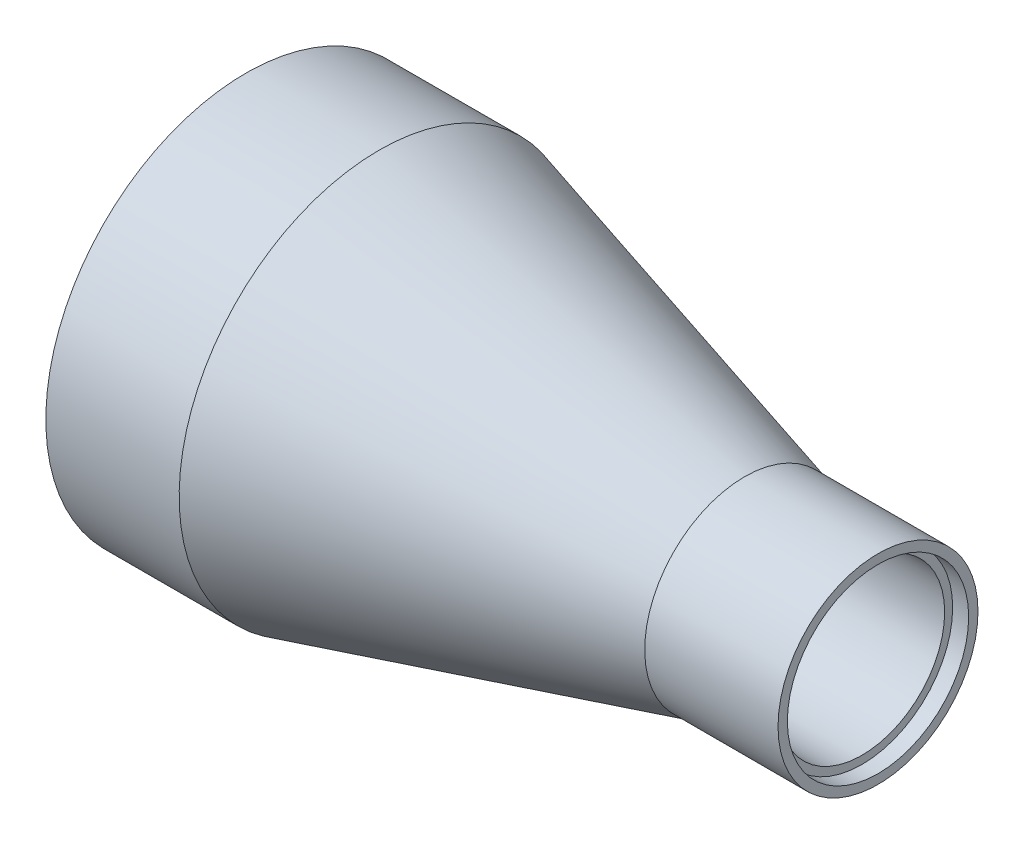
ISO-10303-21;
HEADER;
FILE_DESCRIPTION(('STEP AP214'),'2;1');
FILE_NAME('part.step','',(''),(''),'','','');
FILE_SCHEMA(('AUTOMOTIVE_DESIGN { 1 0 10303 214 1 1 1 1 }'));
ENDSEC;
DATA;
#1=APPLICATION_CONTEXT('core data for automotive mechanical design processes');
#2=APPLICATION_PROTOCOL_DEFINITION('international standard','automotive_design',2000,#1);
#3=PRODUCT_CONTEXT('',#1,'mechanical');
#4=PRODUCT('Part','Part','',(#3));
#5=PRODUCT_RELATED_PRODUCT_CATEGORY('part','',(#4));
#6=PRODUCT_DEFINITION_FORMATION('','',#4);
#7=PRODUCT_DEFINITION_CONTEXT('part definition',#1,'design');
#8=PRODUCT_DEFINITION('design','',#6,#7);
#9=PRODUCT_DEFINITION_SHAPE('','',#8);
#10=(LENGTH_UNIT() NAMED_UNIT(*) SI_UNIT(.MILLI.,.METRE.));
#11=(NAMED_UNIT(*) PLANE_ANGLE_UNIT() SI_UNIT($,.RADIAN.));
#12=(NAMED_UNIT(*) SI_UNIT($,.STERADIAN.) SOLID_ANGLE_UNIT());
#13=UNCERTAINTY_MEASURE_WITH_UNIT(LENGTH_MEASURE(1.E-05),#10,'distance_accuracy_value','');
#14=(GEOMETRIC_REPRESENTATION_CONTEXT(3) GLOBAL_UNCERTAINTY_ASSIGNED_CONTEXT((#13)) GLOBAL_UNIT_ASSIGNED_CONTEXT((#10,
#11,#12)) REPRESENTATION_CONTEXT('',''));
#15=CARTESIAN_POINT('',(0.,0.,0.));
#16=DIRECTION('',(0.,0.,1.));
#17=DIRECTION('',(1.,0.,0.));
#18=AXIS2_PLACEMENT_3D('',#15,#16,#17);
#19=CARTESIAN_POINT('',(53.0005394978668,0.,0.));
#20=DIRECTION('',(1.,0.,0.));
#21=DIRECTION('',(0.,0.,-1.));
#22=AXIS2_PLACEMENT_3D('',#19,#20,#21);
#23=CYLINDRICAL_SURFACE('',#22,7.874);
#24=CARTESIAN_POINT('',(58.6994000000003,0.,0.));
#25=DIRECTION('',(1.,0.,0.));
#26=DIRECTION('',(0.,0.,-1.));
#27=AXIS2_PLACEMENT_3D('',#24,#25,#26);
#28=CIRCLE('',#27,7.874);
#29=CARTESIAN_POINT('',(58.6994000000003,0.,-7.874));
#30=VERTEX_POINT('',#29);
#31=EDGE_CURVE('E17',#30,#30,#28,.F.);
#32=ORIENTED_EDGE('',*,*,#31,.F.);
#33=EDGE_LOOP('',(#32));
#34=FACE_BOUND('',#33,.T.);
#35=CARTESIAN_POINT('',(47.3016789971863,0.,0.));
#36=DIRECTION('',(-1.,0.,0.));
#37=DIRECTION('',(0.,1.,0.));
#38=AXIS2_PLACEMENT_3D('',#35,#36,#37);
#39=CIRCLE('',#38,7.87400000531202);
#40=CARTESIAN_POINT('',(47.3016789971863,7.87400000531202,0.));
#41=VERTEX_POINT('',#40);
#42=EDGE_CURVE('E40',#41,#41,#39,.T.);
#43=ORIENTED_EDGE('',*,*,#42,.T.);
#44=EDGE_LOOP('',(#43));
#45=FACE_BOUND('',#44,.T.);
#46=ADVANCED_FACE('F14',(#34,#45),#23,.F.);
#47=CARTESIAN_POINT('',(58.6994000000003,8.255,0.));
#48=DIRECTION('',(1.,0.,0.));
#49=DIRECTION('',(0.,0.,-1.));
#50=AXIS2_PLACEMENT_3D('',#47,#48,#49);
#51=PLANE('',#50);
#52=ORIENTED_EDGE('',*,*,#31,.T.);
#53=EDGE_LOOP('',(#52));
#54=FACE_BOUND('',#53,.T.);
#55=CARTESIAN_POINT('',(58.6994000000003,0.,0.));
#56=DIRECTION('',(1.,0.,0.));
#57=DIRECTION('',(0.,0.,-1.));
#58=AXIS2_PLACEMENT_3D('',#55,#56,#57);
#59=CIRCLE('',#58,8.63599999999998);
#60=CARTESIAN_POINT('',(58.6994000000003,0.,-8.63599999999998));
#61=VERTEX_POINT('',#60);
#62=EDGE_CURVE('E37',#61,#61,#59,.T.);
#63=ORIENTED_EDGE('',*,*,#62,.T.);
#64=EDGE_LOOP('',(#63));
#65=FACE_BOUND('',#64,.T.);
#66=ADVANCED_FACE('F57',(#54,#65),#51,.T.);
#67=CARTESIAN_POINT('',(12.4782789942799,0.,0.));
#68=DIRECTION('',(-1.,0.,0.));
#69=DIRECTION('',(0.,0.,1.));
#70=AXIS2_PLACEMENT_3D('',#67,#68,#69);
#71=CONICAL_SURFACE('',#70,17.398999994688,0.2669925152044);
#72=ORIENTED_EDGE('',*,*,#42,.F.);
#73=EDGE_LOOP('',(#72));
#74=FACE_BOUND('',#73,.T.);
#75=CARTESIAN_POINT('',(12.4782789957329,0.,0.));
#76=DIRECTION('',(1.,0.,0.));
#77=DIRECTION('',(0.,0.,-1.));
#78=AXIS2_PLACEMENT_3D('',#75,#76,#77);
#79=CIRCLE('',#78,17.399);
#80=CARTESIAN_POINT('',(12.4782789957329,0.,-17.399));
#81=VERTEX_POINT('',#80);
#82=EDGE_CURVE('E33',#81,#81,#79,.F.);
#83=ORIENTED_EDGE('',*,*,#82,.T.);
#84=EDGE_LOOP('',(#83));
#85=FACE_BOUND('',#84,.T.);
#86=ADVANCED_FACE('F62',(#74,#85),#71,.F.);
#87=CARTESIAN_POINT('',(59.4614000000004,0.,0.));
#88=DIRECTION('',(1.,0.,0.));
#89=DIRECTION('',(0.,0.,-1.));
#90=AXIS2_PLACEMENT_3D('',#87,#88,#89);
#91=CYLINDRICAL_SURFACE('',#90,8.63599999999998);
#92=CARTESIAN_POINT('',(60.2234000000005,0.,0.));
#93=DIRECTION('',(1.,0.,0.));
#94=DIRECTION('',(0.,0.,-1.));
#95=AXIS2_PLACEMENT_3D('',#92,#93,#94);
#96=CIRCLE('',#95,8.63599999999998);
#97=CARTESIAN_POINT('',(60.2234000000005,0.,-8.63599999999998));
#98=VERTEX_POINT('',#97);
#99=EDGE_CURVE('E36',#98,#98,#96,.F.);
#100=ORIENTED_EDGE('',*,*,#99,.F.);
#101=EDGE_LOOP('',(#100));
#102=FACE_BOUND('',#101,.T.);
#103=ORIENTED_EDGE('',*,*,#62,.F.);
#104=EDGE_LOOP('',(#103));
#105=FACE_BOUND('',#104,.T.);
#106=ADVANCED_FACE('F59',(#102,#105),#91,.F.);
#107=CARTESIAN_POINT('',(6.23913949786646,0.,0.));
#108=DIRECTION('',(1.,0.,0.));
#109=DIRECTION('',(0.,0.,-1.));
#110=AXIS2_PLACEMENT_3D('',#107,#108,#109);
#111=CYLINDRICAL_SURFACE('',#110,17.399);
#112=ORIENTED_EDGE('',*,*,#82,.F.);
#113=EDGE_LOOP('',(#112));
#114=FACE_BOUND('',#113,.T.);
#115=CARTESIAN_POINT('',(0.,0.,0.));
#116=DIRECTION('',(1.,0.,0.));
#117=DIRECTION('',(0.,0.,-1.));
#118=AXIS2_PLACEMENT_3D('',#115,#116,#117);
#119=CIRCLE('',#118,17.399);
#120=CARTESIAN_POINT('',(0.,0.,-17.399));
#121=VERTEX_POINT('',#120);
#122=EDGE_CURVE('E50',#121,#121,#119,.T.);
#123=ORIENTED_EDGE('',*,*,#122,.F.);
#124=EDGE_LOOP('',(#123));
#125=FACE_BOUND('',#124,.T.);
#126=ADVANCED_FACE('F61',(#114,#125),#111,.F.);
#127=CARTESIAN_POINT('',(60.2234000000005,9.08049999999998,0.));
#128=DIRECTION('',(1.,0.,0.));
#129=DIRECTION('',(0.,0.,-1.));
#130=AXIS2_PLACEMENT_3D('',#127,#128,#129);
#131=PLANE('',#130);
#132=ORIENTED_EDGE('',*,*,#99,.T.);
#133=EDGE_LOOP('',(#132));
#134=FACE_BOUND('',#133,.T.);
#135=CARTESIAN_POINT('',(60.2234000000005,0.,0.));
#136=DIRECTION('',(1.,0.,0.));
#137=DIRECTION('',(0.,0.,-1.));
#138=AXIS2_PLACEMENT_3D('',#135,#136,#137);
#139=CIRCLE('',#138,9.525);
#140=CARTESIAN_POINT('',(60.2234000000005,0.,-9.525));
#141=VERTEX_POINT('',#140);
#142=EDGE_CURVE('E47',#141,#141,#139,.F.);
#143=ORIENTED_EDGE('',*,*,#142,.F.);
#144=EDGE_LOOP('',(#143));
#145=FACE_BOUND('',#144,.T.);
#146=ADVANCED_FACE('F70',(#134,#145),#131,.T.);
#147=CARTESIAN_POINT('',(0.,18.2245,0.));
#148=DIRECTION('',(-1.,0.,0.));
#149=DIRECTION('',(0.,0.,1.));
#150=AXIS2_PLACEMENT_3D('',#147,#148,#149);
#151=PLANE('',#150);
#152=ORIENTED_EDGE('',*,*,#122,.T.);
#153=EDGE_LOOP('',(#152));
#154=FACE_BOUND('',#153,.T.);
#155=CARTESIAN_POINT('',(0.,0.,0.));
#156=DIRECTION('',(1.,0.,0.));
#157=DIRECTION('',(0.,0.,-1.));
#158=AXIS2_PLACEMENT_3D('',#155,#156,#157);
#159=CIRCLE('',#158,19.05);
#160=CARTESIAN_POINT('',(0.,0.,-19.05));
#161=VERTEX_POINT('',#160);
#162=EDGE_CURVE('E26',#161,#161,#159,.T.);
#163=ORIENTED_EDGE('',*,*,#162,.F.);
#164=EDGE_LOOP('',(#163));
#165=FACE_BOUND('',#164,.T.);
#166=ADVANCED_FACE('F90',(#154,#165),#151,.T.);
#167=CARTESIAN_POINT('',(53.8734000000004,0.,0.));
#168=DIRECTION('',(1.,0.,0.));
#169=DIRECTION('',(0.,0.,-1.));
#170=AXIS2_PLACEMENT_3D('',#167,#168,#169);
#171=CYLINDRICAL_SURFACE('',#170,9.525);
#172=CARTESIAN_POINT('',(47.5234000014534,0.,0.));
#173=DIRECTION('',(-1.,0.,0.));
#174=DIRECTION('',(0.,1.,0.));
#175=AXIS2_PLACEMENT_3D('',#172,#173,#174);
#176=CIRCLE('',#175,9.52500000531202);
#177=CARTESIAN_POINT('',(47.5234000014534,9.52500000531202,0.));
#178=VERTEX_POINT('',#177);
#179=EDGE_CURVE('E21',#178,#178,#176,.T.);
#180=ORIENTED_EDGE('',*,*,#179,.F.);
#181=EDGE_LOOP('',(#180));
#182=FACE_BOUND('',#181,.T.);
#183=ORIENTED_EDGE('',*,*,#142,.T.);
#184=EDGE_LOOP('',(#183));
#185=FACE_BOUND('',#184,.T.);
#186=ADVANCED_FACE('F83',(#182,#185),#171,.T.);
#187=CARTESIAN_POINT('',(6.35,0.,0.));
#188=DIRECTION('',(1.,0.,0.));
#189=DIRECTION('',(0.,0.,-1.));
#190=AXIS2_PLACEMENT_3D('',#187,#188,#189);
#191=CYLINDRICAL_SURFACE('',#190,19.05);
#192=ORIENTED_EDGE('',*,*,#162,.T.);
#193=EDGE_LOOP('',(#192));
#194=FACE_BOUND('',#193,.T.);
#195=CARTESIAN_POINT('',(12.699999998547,0.,0.));
#196=DIRECTION('',(-1.,0.,0.));
#197=DIRECTION('',(0.,1.,0.));
#198=AXIS2_PLACEMENT_3D('',#195,#196,#197);
#199=CIRCLE('',#198,19.049999994688);
#200=CARTESIAN_POINT('',(12.699999998547,19.049999994688,0.));
#201=VERTEX_POINT('',#200);
#202=EDGE_CURVE('E10',#201,#201,#199,.F.);
#203=ORIENTED_EDGE('',*,*,#202,.F.);
#204=EDGE_LOOP('',(#203));
#205=FACE_BOUND('',#204,.T.);
#206=ADVANCED_FACE('F78',(#194,#205),#191,.T.);
#207=CARTESIAN_POINT('',(12.699999998547,0.,0.));
#208=DIRECTION('',(-1.,0.,0.));
#209=DIRECTION('',(0.,0.,1.));
#210=AXIS2_PLACEMENT_3D('',#207,#208,#209);
#211=CONICAL_SURFACE('',#210,19.049999994688,0.2669925152044);
#212=ORIENTED_EDGE('',*,*,#202,.T.);
#213=EDGE_LOOP('',(#212));
#214=FACE_BOUND('',#213,.T.);
#215=ORIENTED_EDGE('',*,*,#179,.T.);
#216=EDGE_LOOP('',(#215));
#217=FACE_BOUND('',#216,.T.);
#218=ADVANCED_FACE('F76',(#214,#217),#211,.T.);
#219=CLOSED_SHELL('',(#46,#66,#86,#106,#126,#146,#166,#186,#206,#218));
#220=MANIFOLD_SOLID_BREP('B1',#219);
#221=ADVANCED_BREP_SHAPE_REPRESENTATION('',(#18,#220),#14);
#222=SHAPE_DEFINITION_REPRESENTATION(#9,#221);
ENDSEC;
END-ISO-10303-21;
